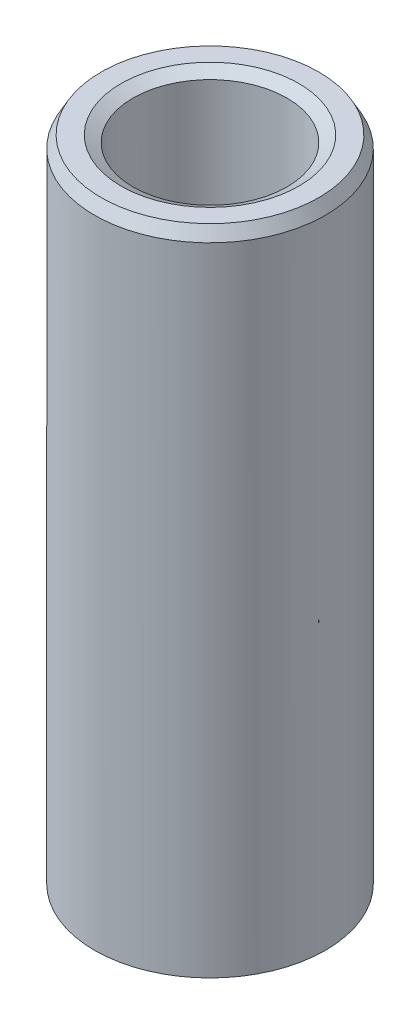
ISO-10303-21;
HEADER;
FILE_DESCRIPTION(('STEP AP214'),'2;1');
FILE_NAME('part.step','',(''),(''),'','','');
FILE_SCHEMA(('AUTOMOTIVE_DESIGN { 1 0 10303 214 1 1 1 1 }'));
ENDSEC;
DATA;
#1=APPLICATION_CONTEXT('core data for automotive mechanical design processes');
#2=APPLICATION_PROTOCOL_DEFINITION('international standard','automotive_design',2000,#1);
#3=PRODUCT_CONTEXT('',#1,'mechanical');
#4=PRODUCT('Part','Part','',(#3));
#5=PRODUCT_RELATED_PRODUCT_CATEGORY('part','',(#4));
#6=PRODUCT_DEFINITION_FORMATION('','',#4);
#7=PRODUCT_DEFINITION_CONTEXT('part definition',#1,'design');
#8=PRODUCT_DEFINITION('design','',#6,#7);
#9=PRODUCT_DEFINITION_SHAPE('','',#8);
#10=(LENGTH_UNIT() NAMED_UNIT(*) SI_UNIT(.MILLI.,.METRE.));
#11=(NAMED_UNIT(*) PLANE_ANGLE_UNIT() SI_UNIT($,.RADIAN.));
#12=(NAMED_UNIT(*) SI_UNIT($,.STERADIAN.) SOLID_ANGLE_UNIT());
#13=UNCERTAINTY_MEASURE_WITH_UNIT(LENGTH_MEASURE(1.E-05),#10,'distance_accuracy_value','');
#14=(GEOMETRIC_REPRESENTATION_CONTEXT(3) GLOBAL_UNCERTAINTY_ASSIGNED_CONTEXT((#13)) GLOBAL_UNIT_ASSIGNED_CONTEXT((#10,
#11,#12)) REPRESENTATION_CONTEXT('',''));
#15=CARTESIAN_POINT('',(0.,0.,0.));
#16=DIRECTION('',(0.,0.,1.));
#17=DIRECTION('',(1.,0.,0.));
#18=AXIS2_PLACEMENT_3D('',#15,#16,#17);
#19=CARTESIAN_POINT('',(0.,212.75859699995,0.));
#20=DIRECTION('',(0.,-1.,0.));
#21=DIRECTION('',(0.,0.,-1.));
#22=AXIS2_PLACEMENT_3D('',#19,#20,#21);
#23=CYLINDRICAL_SURFACE('',#22,37.5);
#24=CARTESIAN_POINT('',(0.,2.15778937401617,0.));
#25=DIRECTION('',(0.,1.,0.));
#26=DIRECTION('',(0.,0.,1.));
#27=AXIS2_PLACEMENT_3D('',#24,#25,#26);
#28=CIRCLE('',#27,37.5);
#29=CARTESIAN_POINT('',(0.,2.15778937401617,37.5));
#30=VERTEX_POINT('',#29);
#31=EDGE_CURVE('E10',#30,#30,#28,.T.);
#32=ORIENTED_EDGE('',*,*,#31,.T.);
#33=EDGE_LOOP('',(#32));
#34=FACE_BOUND('',#33,.T.);
#35=CARTESIAN_POINT('',(0.,208.886685303646,0.));
#36=DIRECTION('',(0.,1.,0.));
#37=DIRECTION('',(0.,0.,1.));
#38=AXIS2_PLACEMENT_3D('',#35,#36,#37);
#39=CIRCLE('',#38,37.5);
#40=CARTESIAN_POINT('',(0.,208.886685303646,-37.5));
#41=VERTEX_POINT('',#40);
#42=EDGE_CURVE('E50',#41,#41,#39,.F.);
#43=ORIENTED_EDGE('',*,*,#42,.T.);
#44=EDGE_LOOP('',(#43));
#45=FACE_BOUND('',#44,.T.);
#46=ADVANCED_FACE('F39',(#34,#45),#23,.T.);
#47=CARTESIAN_POINT('',(0.,212.75859699995,0.));
#48=DIRECTION('',(0.,1.,0.));
#49=DIRECTION('',(0.,0.,1.));
#50=AXIS2_PLACEMENT_3D('',#47,#48,#49);
#51=PLANE('',#50);
#52=CARTESIAN_POINT('',(0.,212.75859699995,0.));
#53=DIRECTION('',(0.,1.,0.));
#54=DIRECTION('',(0.,0.,1.));
#55=AXIS2_PLACEMENT_3D('',#52,#53,#54);
#56=CIRCLE('',#55,28.8750656955924);
#57=CARTESIAN_POINT('',(0.,212.75859699995,28.8750656955924));
#58=VERTEX_POINT('',#57);
#59=EDGE_CURVE('E58',#58,#58,#56,.F.);
#60=ORIENTED_EDGE('',*,*,#59,.T.);
#61=EDGE_LOOP('',(#60));
#62=FACE_BOUND('',#61,.T.);
#63=CARTESIAN_POINT('',(0.,212.75859699995,0.));
#64=DIRECTION('',(0.,1.,0.));
#65=DIRECTION('',(0.,0.,1.));
#66=AXIS2_PLACEMENT_3D('',#63,#64,#65);
#67=CIRCLE('',#66,35.3422106259838);
#68=CARTESIAN_POINT('',(0.,212.75859699995,-35.3422106259838));
#69=VERTEX_POINT('',#68);
#70=EDGE_CURVE('E61',#69,#69,#67,.T.);
#71=ORIENTED_EDGE('',*,*,#70,.T.);
#72=EDGE_LOOP('',(#71));
#73=FACE_BOUND('',#72,.T.);
#74=ADVANCED_FACE('F88',(#62,#73),#51,.T.);
#75=CARTESIAN_POINT('',(0.,0.,0.));
#76=DIRECTION('',(0.,1.,0.));
#77=DIRECTION('',(0.,0.,1.));
#78=AXIS2_PLACEMENT_3D('',#75,#76,#77);
#79=PLANE('',#78);
#80=CARTESIAN_POINT('',(0.,0.,0.));
#81=DIRECTION('',(0.,1.,0.));
#82=DIRECTION('',(0.,0.,1.));
#83=AXIS2_PLACEMENT_3D('',#80,#81,#82);
#84=CIRCLE('',#83,27.1609433733052);
#85=CARTESIAN_POINT('',(0.,0.,-27.1609433733052));
#86=VERTEX_POINT('',#85);
#87=EDGE_CURVE('E51',#86,#86,#84,.T.);
#88=ORIENTED_EDGE('',*,*,#87,.T.);
#89=EDGE_LOOP('',(#88));
#90=FACE_BOUND('',#89,.T.);
#91=CARTESIAN_POINT('',(0.,0.,0.));
#92=DIRECTION('',(0.,1.,0.));
#93=DIRECTION('',(0.,0.,1.));
#94=AXIS2_PLACEMENT_3D('',#91,#92,#93);
#95=CIRCLE('',#94,33.6280883036966);
#96=CARTESIAN_POINT('',(0.,0.,33.6280883036966));
#97=VERTEX_POINT('',#96);
#98=EDGE_CURVE('E54',#97,#97,#95,.F.);
#99=ORIENTED_EDGE('',*,*,#98,.T.);
#100=EDGE_LOOP('',(#99));
#101=FACE_BOUND('',#100,.T.);
#102=ADVANCED_FACE('F83',(#90,#101),#79,.F.);
#103=CARTESIAN_POINT('',(0.,212.75859699995,0.));
#104=DIRECTION('',(0.,-1.,0.));
#105=DIRECTION('',(0.,0.,-1.));
#106=AXIS2_PLACEMENT_3D('',#103,#104,#105);
#107=CYLINDRICAL_SURFACE('',#106,25.003153999289);
#108=CARTESIAN_POINT('',(0.,210.600807625934,0.));
#109=DIRECTION('',(0.,1.,0.));
#110=DIRECTION('',(0.,0.,1.));
#111=AXIS2_PLACEMENT_3D('',#108,#109,#110);
#112=CIRCLE('',#111,25.003153999289);
#113=CARTESIAN_POINT('',(0.,210.600807625934,25.003153999289));
#114=VERTEX_POINT('',#113);
#115=EDGE_CURVE('E67',#114,#114,#112,.T.);
#116=ORIENTED_EDGE('',*,*,#115,.T.);
#117=EDGE_LOOP('',(#116));
#118=FACE_BOUND('',#117,.T.);
#119=CARTESIAN_POINT('',(0.,3.87191169630346,0.));
#120=DIRECTION('',(0.,1.,0.));
#121=DIRECTION('',(0.,0.,1.));
#122=AXIS2_PLACEMENT_3D('',#119,#120,#121);
#123=CIRCLE('',#122,25.003153999289);
#124=CARTESIAN_POINT('',(0.,3.87191169630346,-25.003153999289));
#125=VERTEX_POINT('',#124);
#126=EDGE_CURVE('E69',#125,#125,#123,.F.);
#127=ORIENTED_EDGE('',*,*,#126,.T.);
#128=EDGE_LOOP('',(#127));
#129=FACE_BOUND('',#128,.T.);
#130=ADVANCED_FACE('F71',(#118,#129),#107,.F.);
#131=CARTESIAN_POINT('',(0.,210.600807625934,0.));
#132=DIRECTION('',(0.,1.,0.));
#133=DIRECTION('',(0.,0.,1.));
#134=AXIS2_PLACEMENT_3D('',#131,#132,#133);
#135=CONICAL_SURFACE('',#134,25.003153999289,1.06237111438117);
#136=ORIENTED_EDGE('',*,*,#59,.F.);
#137=EDGE_LOOP('',(#136));
#138=FACE_BOUND('',#137,.T.);
#139=ORIENTED_EDGE('',*,*,#115,.F.);
#140=EDGE_LOOP('',(#139));
#141=FACE_BOUND('',#140,.T.);
#142=ADVANCED_FACE('F77',(#138,#141),#135,.F.);
#143=CARTESIAN_POINT('',(0.,0.,0.));
#144=DIRECTION('',(0.,-1.,0.));
#145=DIRECTION('',(0.,0.,-1.));
#146=AXIS2_PLACEMENT_3D('',#143,#144,#145);
#147=CONICAL_SURFACE('',#146,27.1609433733052,0.508425212413722);
#148=CARTESIAN_POINT('',(0.,3.87191169630346,-25.003153999289));
#149=CARTESIAN_POINT('',(0.,3.8315792828003,-25.025630971935));
#150=CARTESIAN_POINT('',(0.,3.79124686929714,-25.048107944581));
#151=CARTESIAN_POINT('',(0.,3.71058204229082,-25.093061889873));
#152=CARTESIAN_POINT('',(0.,3.67024962878766,-25.115538862519));
#153=CARTESIAN_POINT('',(0.,3.58958480178134,-25.160492807811));
#154=CARTESIAN_POINT('',(0.,3.54925238827818,-25.182969780457));
#155=CARTESIAN_POINT('',(0.,3.46858756127185,-25.227923725749));
#156=CARTESIAN_POINT('',(0.,3.42825514776869,-25.250400698395));
#157=CARTESIAN_POINT('',(0.,3.34759032076237,-25.295354643687));
#158=CARTESIAN_POINT('',(0.,3.30725790725921,-25.317831616333));
#159=CARTESIAN_POINT('',(0.,3.22659308025289,-25.362785561625));
#160=CARTESIAN_POINT('',(0.,3.18626066674973,-25.3852625342711));
#161=CARTESIAN_POINT('',(0.,3.1055958397434,-25.4302164795631));
#162=CARTESIAN_POINT('',(0.,3.06526342624024,-25.4526934522091));
#163=CARTESIAN_POINT('',(0.,2.98459859923392,-25.4976473975011));
#164=CARTESIAN_POINT('',(0.,2.94426618573076,-25.5201243701471));
#165=CARTESIAN_POINT('',(0.,2.86360135872444,-25.5650783154391));
#166=CARTESIAN_POINT('',(0.,2.82326894522128,-25.5875552880851));
#167=CARTESIAN_POINT('',(0.,2.74260411821495,-25.6325092333771));
#168=CARTESIAN_POINT('',(0.,2.70227170471179,-25.6549862060231));
#169=CARTESIAN_POINT('',(0.,2.62160687770547,-25.6999401513151));
#170=CARTESIAN_POINT('',(0.,2.58127446420231,-25.7224171239611));
#171=CARTESIAN_POINT('',(0.,2.50060963719599,-25.7673710692531));
#172=CARTESIAN_POINT('',(0.,2.46027722369283,-25.7898480418991));
#173=CARTESIAN_POINT('',(0.,2.3796123966865,-25.8348019871911));
#174=CARTESIAN_POINT('',(0.,2.33927998318334,-25.8572789598371));
#175=CARTESIAN_POINT('',(0.,2.25861515617702,-25.9022329051291));
#176=CARTESIAN_POINT('',(0.,2.21828274267386,-25.9247098777751));
#177=CARTESIAN_POINT('',(0.,2.13761791566754,-25.9696638230671));
#178=CARTESIAN_POINT('',(0.,2.09728550216438,-25.9921407957131));
#179=CARTESIAN_POINT('',(0.,2.01662067515805,-26.0370947410051));
#180=CARTESIAN_POINT('',(0.,1.97628826165489,-26.0595717136511));
#181=CARTESIAN_POINT('',(0.,1.89562343464857,-26.1045256589431));
#182=CARTESIAN_POINT('',(0.,1.85529102114541,-26.1270026315891));
#183=CARTESIAN_POINT('',(0.,1.77462619413909,-26.1719565768811));
#184=CARTESIAN_POINT('',(0.,1.73429378063593,-26.1944335495271));
#185=CARTESIAN_POINT('',(0.,1.6536289536296,-26.2393874948191));
#186=CARTESIAN_POINT('',(0.,1.61329654012644,-26.2618644674651));
#187=CARTESIAN_POINT('',(0.,1.53263171312012,-26.3068184127571));
#188=CARTESIAN_POINT('',(0.,1.49229929961696,-26.3292953854031));
#189=CARTESIAN_POINT('',(0.,1.41163447261064,-26.3742493306951));
#190=CARTESIAN_POINT('',(0.,1.37130205910748,-26.3967263033411));
#191=CARTESIAN_POINT('',(0.,1.29063723210115,-26.4416802486331));
#192=CARTESIAN_POINT('',(0.,1.25030481859799,-26.4641572212792));
#193=CARTESIAN_POINT('',(0.,1.16963999159167,-26.5091111665712));
#194=CARTESIAN_POINT('',(0.,1.12930757808851,-26.5315881392172));
#195=CARTESIAN_POINT('',(0.,1.04864275108219,-26.5765420845092));
#196=CARTESIAN_POINT('',(0.,1.00831033757903,-26.5990190571552));
#197=CARTESIAN_POINT('',(0.,0.927645510572705,-26.6439730024472));
#198=CARTESIAN_POINT('',(0.,0.887313097069544,-26.6664499750932));
#199=CARTESIAN_POINT('',(0.,0.806648270063222,-26.7114039203852));
#200=CARTESIAN_POINT('',(0.,0.766315856560061,-26.7338808930312));
#201=CARTESIAN_POINT('',(0.,0.685651029553739,-26.7788348383232));
#202=CARTESIAN_POINT('',(0.,0.645318616050578,-26.8013118109692));
#203=CARTESIAN_POINT('',(0.,0.564653789044255,-26.8462657562612));
#204=CARTESIAN_POINT('',(0.,0.524321375541094,-26.8687427289072));
#205=CARTESIAN_POINT('',(0.,0.443656548534772,-26.9136966741992));
#206=CARTESIAN_POINT('',(0.,0.403324135031611,-26.9361736468452));
#207=CARTESIAN_POINT('',(0.,0.322659308025289,-26.9811275921372));
#208=CARTESIAN_POINT('',(0.,0.282326894522128,-27.0036045647832));
#209=CARTESIAN_POINT('',(0.,0.201662067515806,-27.0485585100752));
#210=CARTESIAN_POINT('',(0.,0.161329654012644,-27.0710354827212));
#211=CARTESIAN_POINT('',(0.,0.0806648270063217,-27.1159894280132));
#212=CARTESIAN_POINT('',(0.,0.0403324135031604,-27.1384664006592));
#213=CARTESIAN_POINT('',(0.,0.,-27.1609433733052));
#214=B_SPLINE_CURVE_WITH_KNOTS('',3,(#148,#149,#150,#151,#152,#153,#154,#155,#156,#157,#158,
#159,#160,#161,#162,#163,#164,#165,#166,#167,#168,#169,#170,#171,#172,#173,#174,#175,#176,#177,
#178,#179,#180,#181,#182,#183,#184,#185,#186,#187,#188,#189,#190,#191,#192,#193,#194,#195,#196,
#197,#198,#199,#200,#201,#202,#203,#204,#205,#206,#207,#208,#209,#210,#211,#212,#213),
.UNSPECIFIED.,.F.,.F.,(4,2,2,2,2,2,2,2,2,2,2,2,2,2,2,2,2,2,2,2,2,2,2,2,2,2,2,2,2,2,2,2,4),(0.,
0.13851808872805,0.277036177456099,0.415554266184149,0.554072354912199,0.692590443640248,
0.831108532368298,0.969626621096348,1.1081447098244,1.24666279855245,1.3851808872805,
1.52369897600855,1.6622170647366,1.80073515346465,1.9392532421927,2.07777133092075,
2.2162894196488,2.35480750837685,2.49332559710489,2.63184368583294,2.77036177456099,
2.90887986328904,3.04739795201709,3.18591604074514,3.32443412947319,3.46295221820124,
3.60147030692929,3.73998839565734,3.87850648438539,4.01702457311344,4.15554266184149,
4.29406075056954,4.43257883929759),.UNSPECIFIED.);
#215=EDGE_CURVE('BSEAM73',#125,#86,#214,.T.);
#216=ORIENTED_EDGE('',*,*,#126,.F.);
#217=ORIENTED_EDGE('',*,*,#87,.F.);
#218=ORIENTED_EDGE('',*,*,#215,.T.);
#219=ORIENTED_EDGE('',*,*,#215,.F.);
#220=EDGE_LOOP('',(#216,#218,#217,#219));
#221=FACE_BOUND('',#220,.T.);
#222=ADVANCED_FACE('F73',(#221),#147,.F.);
#223=CARTESIAN_POINT('',(0.,2.15778937401617,0.));
#224=DIRECTION('',(0.,1.,0.));
#225=DIRECTION('',(0.,0.,1.));
#226=AXIS2_PLACEMENT_3D('',#223,#224,#225);
#227=CONICAL_SURFACE('',#226,37.5,1.06237111438118);
#228=ORIENTED_EDGE('',*,*,#98,.F.);
#229=EDGE_LOOP('',(#228));
#230=FACE_BOUND('',#229,.T.);
#231=ORIENTED_EDGE('',*,*,#31,.F.);
#232=EDGE_LOOP('',(#231));
#233=FACE_BOUND('',#232,.T.);
#234=ADVANCED_FACE('F76',(#230,#233),#227,.T.);
#235=CARTESIAN_POINT('',(0.,212.75859699995,0.));
#236=DIRECTION('',(0.,-1.,0.));
#237=DIRECTION('',(0.,0.,-1.));
#238=AXIS2_PLACEMENT_3D('',#235,#236,#237);
#239=CONICAL_SURFACE('',#238,35.3422106259838,0.50842521241372);
#240=CARTESIAN_POINT('',(0.,208.886685303646,-37.5));
#241=CARTESIAN_POINT('',(0.,208.927017717149,-37.477523027354));
#242=CARTESIAN_POINT('',(0.,208.967350130653,-37.455046054708));
#243=CARTESIAN_POINT('',(0.,209.048014957659,-37.410092109416));
#244=CARTESIAN_POINT('',(0.,209.088347371162,-37.38761513677));
#245=CARTESIAN_POINT('',(0.,209.169012198168,-37.342661191478));
#246=CARTESIAN_POINT('',(0.,209.209344611671,-37.320184218832));
#247=CARTESIAN_POINT('',(0.,209.290009438678,-37.27523027354));
#248=CARTESIAN_POINT('',(0.,209.330341852181,-37.252753300894));
#249=CARTESIAN_POINT('',(0.,209.411006679187,-37.207799355602));
#250=CARTESIAN_POINT('',(0.,209.45133909269,-37.185322382956));
#251=CARTESIAN_POINT('',(0.,209.532003919697,-37.140368437664));
#252=CARTESIAN_POINT('',(0.,209.5723363332,-37.117891465018));
#253=CARTESIAN_POINT('',(0.,209.653001160206,-37.072937519726));
#254=CARTESIAN_POINT('',(0.,209.693333573709,-37.05046054708));
#255=CARTESIAN_POINT('',(0.,209.773998400716,-37.005506601788));
#256=CARTESIAN_POINT('',(0.,209.814330814219,-36.983029629142));
#257=CARTESIAN_POINT('',(0.,209.894995641225,-36.93807568385));
#258=CARTESIAN_POINT('',(0.,209.935328054728,-36.915598711204));
#259=CARTESIAN_POINT('',(0.,210.015992881735,-36.870644765912));
#260=CARTESIAN_POINT('',(0.,210.056325295238,-36.848167793266));
#261=CARTESIAN_POINT('',(0.,210.136990122244,-36.803213847974));
#262=CARTESIAN_POINT('',(0.,210.177322535747,-36.780736875328));
#263=CARTESIAN_POINT('',(0.,210.257987362754,-36.7357829300359));
#264=CARTESIAN_POINT('',(0.,210.298319776257,-36.7133059573899));
#265=CARTESIAN_POINT('',(0.,210.378984603263,-36.6683520120979));
#266=CARTESIAN_POINT('',(0.,210.419317016766,-36.6458750394519));
#267=CARTESIAN_POINT('',(0.,210.499981843773,-36.6009210941599));
#268=CARTESIAN_POINT('',(0.,210.540314257276,-36.5784441215139));
#269=CARTESIAN_POINT('',(0.,210.620979084282,-36.5334901762219));
#270=CARTESIAN_POINT('',(0.,210.661311497785,-36.5110132035759));
#271=CARTESIAN_POINT('',(0.,210.741976324792,-36.4660592582839));
#272=CARTESIAN_POINT('',(0.,210.782308738295,-36.4435822856379));
#273=CARTESIAN_POINT('',(0.,210.862973565301,-36.3986283403459));
#274=CARTESIAN_POINT('',(0.,210.903305978804,-36.3761513676999));
#275=CARTESIAN_POINT('',(0.,210.983970805811,-36.3311974224079));
#276=CARTESIAN_POINT('',(0.,211.024303219314,-36.3087204497619));
#277=CARTESIAN_POINT('',(0.,211.10496804632,-36.2637665044699));
#278=CARTESIAN_POINT('',(0.,211.145300459823,-36.2412895318239));
#279=CARTESIAN_POINT('',(0.,211.22596528683,-36.1963355865319));
#280=CARTESIAN_POINT('',(0.,211.266297700333,-36.1738586138859));
#281=CARTESIAN_POINT('',(0.,211.346962527339,-36.1289046685939));
#282=CARTESIAN_POINT('',(0.,211.387294940842,-36.1064276959479));
#283=CARTESIAN_POINT('',(0.,211.467959767849,-36.0614737506559));
#284=CARTESIAN_POINT('',(0.,211.508292181352,-36.0389967780099));
#285=CARTESIAN_POINT('',(0.,211.588957008358,-35.9940428327179));
#286=CARTESIAN_POINT('',(0.,211.629289421861,-35.9715658600719));
#287=CARTESIAN_POINT('',(0.,211.709954248867,-35.9266119147799));
#288=CARTESIAN_POINT('',(0.,211.750286662371,-35.9041349421339));
#289=CARTESIAN_POINT('',(0.,211.830951489377,-35.8591809968419));
#290=CARTESIAN_POINT('',(0.,211.87128390288,-35.8367040241959));
#291=CARTESIAN_POINT('',(0.,211.951948729886,-35.7917500789039));
#292=CARTESIAN_POINT('',(0.,211.99228114339,-35.7692731062579));
#293=CARTESIAN_POINT('',(0.,212.072945970396,-35.7243191609659));
#294=CARTESIAN_POINT('',(0.,212.113278383899,-35.7018421883199));
#295=CARTESIAN_POINT('',(0.,212.193943210905,-35.6568882430279));
#296=CARTESIAN_POINT('',(0.,212.234275624409,-35.6344112703819));
#297=CARTESIAN_POINT('',(0.,212.314940451415,-35.5894573250898));
#298=CARTESIAN_POINT('',(0.,212.355272864918,-35.5669803524438));
#299=CARTESIAN_POINT('',(0.,212.435937691924,-35.5220264071518));
#300=CARTESIAN_POINT('',(0.,212.476270105428,-35.4995494345058));
#301=CARTESIAN_POINT('',(0.,212.556934932434,-35.4545954892138));
#302=CARTESIAN_POINT('',(0.,212.597267345937,-35.4321185165678));
#303=CARTESIAN_POINT('',(0.,212.677932172943,-35.3871645712758));
#304=CARTESIAN_POINT('',(0.,212.718264586447,-35.3646875986298));
#305=CARTESIAN_POINT('',(0.,212.75859699995,-35.3422106259838));
#306=B_SPLINE_CURVE_WITH_KNOTS('',3,(#240,#241,#242,#243,#244,#245,#246,#247,#248,#249,#250,
#251,#252,#253,#254,#255,#256,#257,#258,#259,#260,#261,#262,#263,#264,#265,#266,#267,#268,#269,
#270,#271,#272,#273,#274,#275,#276,#277,#278,#279,#280,#281,#282,#283,#284,#285,#286,#287,#288,
#289,#290,#291,#292,#293,#294,#295,#296,#297,#298,#299,#300,#301,#302,#303,#304,#305),
.UNSPECIFIED.,.F.,.F.,(4,2,2,2,2,2,2,2,2,2,2,2,2,2,2,2,2,2,2,2,2,2,2,2,2,2,2,2,2,2,2,2,4),(0.,
0.13851808872805,0.2770361774561,0.415554266184154,0.554072354912204,0.692590443640254,
0.831108532368307,0.969626621096357,1.10814470982441,1.24666279855246,1.38518088728051,
1.52369897600856,1.66221706473661,1.80073515346466,1.93925324219271,2.07777133092076,
2.21628941964879,2.35480750837684,2.49332559710489,2.63184368583295,2.770361774561,
2.90887986328905,3.0473979520171,3.18591604074515,3.3244341294732,3.46295221820125,
3.6014703069293,3.73998839565735,3.87850648438541,4.01702457311346,4.15554266184151,
4.29406075056956,4.43257883929761),.UNSPECIFIED.);
#307=EDGE_CURVE('BSEAM45',#41,#69,#306,.T.);
#308=ORIENTED_EDGE('',*,*,#42,.F.);
#309=ORIENTED_EDGE('',*,*,#70,.F.);
#310=ORIENTED_EDGE('',*,*,#307,.T.);
#311=ORIENTED_EDGE('',*,*,#307,.F.);
#312=EDGE_LOOP('',(#308,#310,#309,#311));
#313=FACE_BOUND('',#312,.T.);
#314=ADVANCED_FACE('F45',(#313),#239,.T.);
#315=CLOSED_SHELL('',(#46,#74,#102,#130,#142,#222,#234,#314));
#316=MANIFOLD_SOLID_BREP('B2',#315);
#317=ADVANCED_BREP_SHAPE_REPRESENTATION('',(#18,#316),#14);
#318=SHAPE_DEFINITION_REPRESENTATION(#9,#317);
ENDSEC;
END-ISO-10303-21;
